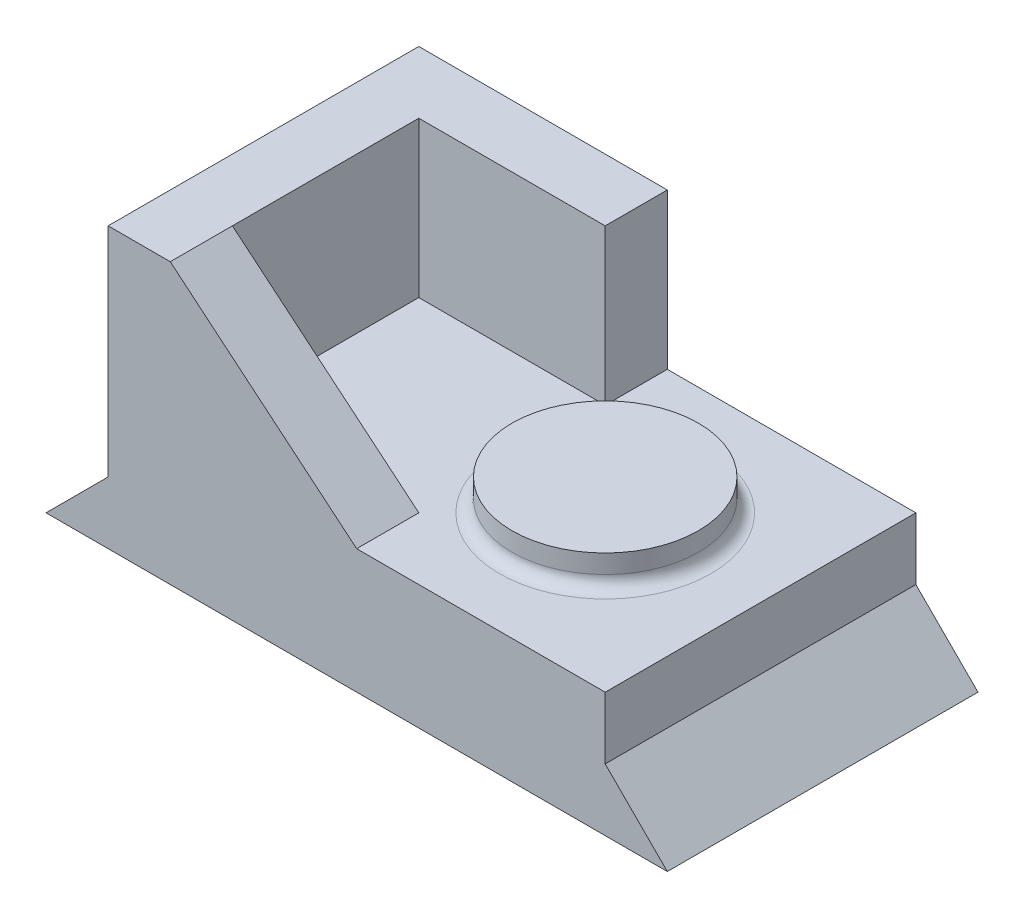
ISO-10303-21;
HEADER;
FILE_DESCRIPTION(('STEP AP214'),'2;1');
FILE_NAME('part.step','',(''),(''),'','','');
FILE_SCHEMA(('AUTOMOTIVE_DESIGN { 1 0 10303 214 1 1 1 1 }'));
ENDSEC;
DATA;
#1=APPLICATION_CONTEXT('core data for automotive mechanical design processes');
#2=APPLICATION_PROTOCOL_DEFINITION('international standard','automotive_design',2000,#1);
#3=PRODUCT_CONTEXT('',#1,'mechanical');
#4=PRODUCT('Part','Part','',(#3));
#5=PRODUCT_RELATED_PRODUCT_CATEGORY('part','',(#4));
#6=PRODUCT_DEFINITION_FORMATION('','',#4);
#7=PRODUCT_DEFINITION_CONTEXT('part definition',#1,'design');
#8=PRODUCT_DEFINITION('design','',#6,#7);
#9=PRODUCT_DEFINITION_SHAPE('','',#8);
#10=(LENGTH_UNIT() NAMED_UNIT(*) SI_UNIT(.MILLI.,.METRE.));
#11=(NAMED_UNIT(*) PLANE_ANGLE_UNIT() SI_UNIT($,.RADIAN.));
#12=(NAMED_UNIT(*) SI_UNIT($,.STERADIAN.) SOLID_ANGLE_UNIT());
#13=UNCERTAINTY_MEASURE_WITH_UNIT(LENGTH_MEASURE(1.E-05),#10,'distance_accuracy_value','');
#14=(GEOMETRIC_REPRESENTATION_CONTEXT(3) GLOBAL_UNCERTAINTY_ASSIGNED_CONTEXT((#13)) GLOBAL_UNIT_ASSIGNED_CONTEXT((#10,
#11,#12)) REPRESENTATION_CONTEXT('',''));
#15=CARTESIAN_POINT('',(0.,0.,0.));
#16=DIRECTION('',(0.,0.,1.));
#17=DIRECTION('',(1.,0.,0.));
#18=AXIS2_PLACEMENT_3D('',#15,#16,#17);
#19=CARTESIAN_POINT('',(0.,20.,25.));
#20=DIRECTION('',(0.,-1.,0.));
#21=DIRECTION('',(1.,0.,0.));
#22=AXIS2_PLACEMENT_3D('',#19,#20,#21);
#23=PLANE('',#22);
#24=CARTESIAN_POINT('',(65.,20.,0.));
#25=DIRECTION('',(0.,-1.,0.));
#26=DIRECTION('',(1.,0.,0.));
#27=AXIS2_PLACEMENT_3D('',#24,#25,#26);
#28=CIRCLE('',#27,17.);
#29=CARTESIAN_POINT('',(82.,20.,0.));
#30=VERTEX_POINT('',#29);
#31=EDGE_CURVE('E11',#30,#30,#28,.T.);
#32=ORIENTED_EDGE('',*,*,#31,.T.);
#33=EDGE_LOOP('',(#32));
#34=FACE_BOUND('',#33,.T.);
#35=DIRECTION('',(-1.,0.,0.));
#36=VECTOR('',#35,1.);
#37=CARTESIAN_POINT('',(0.,20.,-25.));
#38=LINE('',#37,#36);
#39=CARTESIAN_POINT('',(90.,20.,-25.));
#40=VERTEX_POINT('',#39);
#41=CARTESIAN_POINT('',(50.,20.,-25.));
#42=VERTEX_POINT('',#41);
#43=EDGE_CURVE('E154',#40,#42,#38,.T.);
#44=ORIENTED_EDGE('',*,*,#43,.T.);
#45=DIRECTION('',(0.,0.,1.));
#46=VECTOR('',#45,1.);
#47=CARTESIAN_POINT('',(50.,20.,-64.0512483795333));
#48=LINE('',#47,#46);
#49=CARTESIAN_POINT('',(50.,20.,-15.));
#50=VERTEX_POINT('',#49);
#51=EDGE_CURVE('E145',#42,#50,#48,.T.);
#52=ORIENTED_EDGE('',*,*,#51,.T.);
#53=DIRECTION('',(-1.,0.,0.));
#54=VECTOR('',#53,1.);
#55=CARTESIAN_POINT('',(0.,20.,-15.));
#56=LINE('',#55,#54);
#57=CARTESIAN_POINT('',(20.,20.,-15.));
#58=VERTEX_POINT('',#57);
#59=EDGE_CURVE('E132',#50,#58,#56,.T.);
#60=ORIENTED_EDGE('',*,*,#59,.T.);
#61=DIRECTION('',(0.,0.,-1.));
#62=VECTOR('',#61,1.);
#63=CARTESIAN_POINT('',(20.,20.,25.));
#64=LINE('',#63,#62);
#65=CARTESIAN_POINT('',(20.,20.,15.));
#66=VERTEX_POINT('',#65);
#67=EDGE_CURVE('E214',#66,#58,#64,.T.);
#68=ORIENTED_EDGE('',*,*,#67,.F.);
#69=DIRECTION('',(-1.,0.,0.));
#70=VECTOR('',#69,1.);
#71=CARTESIAN_POINT('',(0.,20.,15.));
#72=LINE('',#71,#70);
#73=CARTESIAN_POINT('',(50.,20.,15.));
#74=VERTEX_POINT('',#73);
#75=EDGE_CURVE('E60',#74,#66,#72,.T.);
#76=ORIENTED_EDGE('',*,*,#75,.F.);
#77=DIRECTION('',(0.,0.,-1.));
#78=VECTOR('',#77,1.);
#79=CARTESIAN_POINT('',(50.,20.,64.0512483795333));
#80=LINE('',#79,#78);
#81=CARTESIAN_POINT('',(50.,20.,25.));
#82=VERTEX_POINT('',#81);
#83=EDGE_CURVE('E164',#82,#74,#80,.T.);
#84=ORIENTED_EDGE('',*,*,#83,.F.);
#85=DIRECTION('',(-1.,0.,0.));
#86=VECTOR('',#85,1.);
#87=CARTESIAN_POINT('',(0.,20.,25.));
#88=LINE('',#87,#86);
#89=CARTESIAN_POINT('',(90.,20.,25.));
#90=VERTEX_POINT('',#89);
#91=EDGE_CURVE('E180',#90,#82,#88,.T.);
#92=ORIENTED_EDGE('',*,*,#91,.F.);
#93=DIRECTION('',(0.,0.,-1.));
#94=VECTOR('',#93,1.);
#95=CARTESIAN_POINT('',(90.,20.,25.));
#96=LINE('',#95,#94);
#97=EDGE_CURVE('E216',#90,#40,#96,.T.);
#98=ORIENTED_EDGE('',*,*,#97,.T.);
#99=EDGE_LOOP('',(#44,#52,#60,#68,#76,#84,#92,#98));
#100=FACE_BOUND('',#99,.T.);
#101=ADVANCED_FACE('F45',(#34,#100),#23,.F.);
#102=CARTESIAN_POINT('',(20.,0.,25.));
#103=DIRECTION('',(1.,0.,0.));
#104=DIRECTION('',(0.,1.,0.));
#105=AXIS2_PLACEMENT_3D('',#102,#103,#104);
#106=PLANE('',#105);
#107=DIRECTION('',(0.,-1.,0.));
#108=VECTOR('',#107,1.);
#109=CARTESIAN_POINT('',(20.,0.,-15.));
#110=LINE('',#109,#108);
#111=CARTESIAN_POINT('',(20.,45.,-15.));
#112=VERTEX_POINT('',#111);
#113=EDGE_CURVE('E137',#112,#58,#110,.T.);
#114=ORIENTED_EDGE('',*,*,#113,.F.);
#115=DIRECTION('',(0.,0.,-1.));
#116=VECTOR('',#115,1.);
#117=CARTESIAN_POINT('',(20.,45.,25.));
#118=LINE('',#117,#116);
#119=CARTESIAN_POINT('',(20.,45.,15.));
#120=VERTEX_POINT('',#119);
#121=EDGE_CURVE('E210',#120,#112,#118,.T.);
#122=ORIENTED_EDGE('',*,*,#121,.F.);
#123=DIRECTION('',(0.,-1.,0.));
#124=VECTOR('',#123,1.);
#125=CARTESIAN_POINT('',(20.,0.,15.));
#126=LINE('',#125,#124);
#127=EDGE_CURVE('E68',#120,#66,#126,.T.);
#128=ORIENTED_EDGE('',*,*,#127,.T.);
#129=ORIENTED_EDGE('',*,*,#67,.T.);
#130=EDGE_LOOP('',(#114,#122,#128,#129));
#131=FACE_BOUND('',#130,.T.);
#132=ADVANCED_FACE('F238',(#131),#106,.T.);
#133=CARTESIAN_POINT('',(0.,0.,25.));
#134=DIRECTION('',(0.,1.,0.));
#135=DIRECTION('',(0.,0.,1.));
#136=AXIS2_PLACEMENT_3D('',#133,#134,#135);
#137=PLANE('',#136);
#138=DIRECTION('',(1.,0.,0.));
#139=VECTOR('',#138,1.);
#140=CARTESIAN_POINT('',(0.,0.,-25.));
#141=LINE('',#140,#139);
#142=CARTESIAN_POINT('',(0.,0.,-25.));
#143=VERTEX_POINT('',#142);
#144=CARTESIAN_POINT('',(100.,0.,-25.));
#145=VERTEX_POINT('',#144);
#146=EDGE_CURVE('E168',#143,#145,#141,.T.);
#147=ORIENTED_EDGE('',*,*,#146,.T.);
#148=DIRECTION('',(0.,0.,-1.));
#149=VECTOR('',#148,1.);
#150=CARTESIAN_POINT('',(100.,0.,25.));
#151=LINE('',#150,#149);
#152=CARTESIAN_POINT('',(100.,0.,25.));
#153=VERTEX_POINT('',#152);
#154=EDGE_CURVE('E221',#153,#145,#151,.T.);
#155=ORIENTED_EDGE('',*,*,#154,.F.);
#156=DIRECTION('',(1.,0.,0.));
#157=VECTOR('',#156,1.);
#158=CARTESIAN_POINT('',(0.,0.,25.));
#159=LINE('',#158,#157);
#160=CARTESIAN_POINT('',(0.,0.,25.));
#161=VERTEX_POINT('',#160);
#162=EDGE_CURVE('E172',#161,#153,#159,.T.);
#163=ORIENTED_EDGE('',*,*,#162,.F.);
#164=DIRECTION('',(0.,0.,-1.));
#165=VECTOR('',#164,1.);
#166=CARTESIAN_POINT('',(0.,0.,25.));
#167=LINE('',#166,#165);
#168=EDGE_CURVE('E189',#161,#143,#167,.T.);
#169=ORIENTED_EDGE('',*,*,#168,.T.);
#170=EDGE_LOOP('',(#147,#155,#163,#169));
#171=FACE_BOUND('',#170,.T.);
#172=ADVANCED_FACE('F244',(#171),#137,.F.);
#173=CARTESIAN_POINT('',(50.,50.,25.));
#174=DIRECTION('',(-0.707106781186548,-0.707106781186547,0.));
#175=DIRECTION('',(0.707106781186547,-0.707106781186548,0.));
#176=AXIS2_PLACEMENT_3D('',#173,#174,#175);
#177=PLANE('',#176);
#178=DIRECTION('',(-0.707106781186547,0.707106781186548,0.));
#179=VECTOR('',#178,1.);
#180=CARTESIAN_POINT('',(50.,50.,-25.));
#181=LINE('',#180,#179);
#182=CARTESIAN_POINT('',(90.,9.99999999999999,-25.));
#183=VERTEX_POINT('',#182);
#184=EDGE_CURVE('E192',#145,#183,#181,.T.);
#185=ORIENTED_EDGE('',*,*,#184,.T.);
#186=DIRECTION('',(0.,0.,-1.));
#187=VECTOR('',#186,1.);
#188=CARTESIAN_POINT('',(90.,9.99999999999999,25.));
#189=LINE('',#188,#187);
#190=CARTESIAN_POINT('',(90.,9.99999999999999,25.));
#191=VERTEX_POINT('',#190);
#192=EDGE_CURVE('E218',#191,#183,#189,.T.);
#193=ORIENTED_EDGE('',*,*,#192,.F.);
#194=DIRECTION('',(-0.707106781186547,0.707106781186548,0.));
#195=VECTOR('',#194,1.);
#196=CARTESIAN_POINT('',(50.,50.,25.));
#197=LINE('',#196,#195);
#198=EDGE_CURVE('E175',#153,#191,#197,.T.);
#199=ORIENTED_EDGE('',*,*,#198,.F.);
#200=ORIENTED_EDGE('',*,*,#154,.T.);
#201=EDGE_LOOP('',(#185,#193,#199,#200));
#202=FACE_BOUND('',#201,.T.);
#203=ADVANCED_FACE('F252',(#202),#177,.F.);
#204=CARTESIAN_POINT('',(90.,0.,25.));
#205=DIRECTION('',(-1.,0.,0.));
#206=DIRECTION('',(0.,0.,1.));
#207=AXIS2_PLACEMENT_3D('',#204,#205,#206);
#208=PLANE('',#207);
#209=DIRECTION('',(0.,1.,0.));
#210=VECTOR('',#209,1.);
#211=CARTESIAN_POINT('',(90.,0.,-25.));
#212=LINE('',#211,#210);
#213=EDGE_CURVE('E194',#183,#40,#212,.T.);
#214=ORIENTED_EDGE('',*,*,#213,.T.);
#215=ORIENTED_EDGE('',*,*,#97,.F.);
#216=DIRECTION('',(0.,1.,0.));
#217=VECTOR('',#216,1.);
#218=CARTESIAN_POINT('',(90.,0.,25.));
#219=LINE('',#218,#217);
#220=EDGE_CURVE('E178',#191,#90,#219,.T.);
#221=ORIENTED_EDGE('',*,*,#220,.F.);
#222=ORIENTED_EDGE('',*,*,#192,.T.);
#223=EDGE_LOOP('',(#214,#215,#221,#222));
#224=FACE_BOUND('',#223,.T.);
#225=ADVANCED_FACE('F248',(#224),#208,.F.);
#226=CARTESIAN_POINT('',(0.,45.,25.));
#227=DIRECTION('',(0.,-1.,0.));
#228=DIRECTION('',(1.,0.,0.));
#229=AXIS2_PLACEMENT_3D('',#226,#227,#228);
#230=PLANE('',#229);
#231=DIRECTION('',(-1.,0.,0.));
#232=VECTOR('',#231,1.);
#233=CARTESIAN_POINT('',(0.,45.,-25.));
#234=LINE('',#233,#232);
#235=CARTESIAN_POINT('',(50.,45.,-25.));
#236=VERTEX_POINT('',#235);
#237=CARTESIAN_POINT('',(10.,45.,-25.));
#238=VERTEX_POINT('',#237);
#239=EDGE_CURVE('E197',#236,#238,#234,.T.);
#240=ORIENTED_EDGE('',*,*,#239,.T.);
#241=DIRECTION('',(0.,0.,-1.));
#242=VECTOR('',#241,1.);
#243=CARTESIAN_POINT('',(10.,45.,25.));
#244=LINE('',#243,#242);
#245=CARTESIAN_POINT('',(10.,45.,25.));
#246=VERTEX_POINT('',#245);
#247=EDGE_CURVE('E207',#246,#238,#244,.T.);
#248=ORIENTED_EDGE('',*,*,#247,.F.);
#249=DIRECTION('',(-1.,0.,0.));
#250=VECTOR('',#249,1.);
#251=CARTESIAN_POINT('',(0.,45.,25.));
#252=LINE('',#251,#250);
#253=CARTESIAN_POINT('',(20.,45.,25.));
#254=VERTEX_POINT('',#253);
#255=EDGE_CURVE('E183',#254,#246,#252,.T.);
#256=ORIENTED_EDGE('',*,*,#255,.F.);
#257=EDGE_CURVE('E211',#254,#120,#118,.T.);
#258=ORIENTED_EDGE('',*,*,#257,.T.);
#259=ORIENTED_EDGE('',*,*,#121,.T.);
#260=DIRECTION('',(-1.,0.,0.));
#261=VECTOR('',#260,1.);
#262=CARTESIAN_POINT('',(0.,45.,-15.));
#263=LINE('',#262,#261);
#264=CARTESIAN_POINT('',(50.,45.,-15.));
#265=VERTEX_POINT('',#264);
#266=EDGE_CURVE('E150',#265,#112,#263,.T.);
#267=ORIENTED_EDGE('',*,*,#266,.F.);
#268=DIRECTION('',(0.,0.,1.));
#269=VECTOR('',#268,1.);
#270=CARTESIAN_POINT('',(50.,45.,-64.0512483795333));
#271=LINE('',#270,#269);
#272=EDGE_CURVE('E148',#236,#265,#271,.T.);
#273=ORIENTED_EDGE('',*,*,#272,.F.);
#274=EDGE_LOOP('',(#240,#248,#256,#258,#259,#267,#273));
#275=FACE_BOUND('',#274,.T.);
#276=ADVANCED_FACE('F251',(#275),#230,.F.);
#277=CARTESIAN_POINT('',(10.,0.,25.));
#278=DIRECTION('',(1.,0.,0.));
#279=DIRECTION('',(0.,1.,0.));
#280=AXIS2_PLACEMENT_3D('',#277,#278,#279);
#281=PLANE('',#280);
#282=DIRECTION('',(0.,-1.,0.));
#283=VECTOR('',#282,1.);
#284=CARTESIAN_POINT('',(10.,0.,-25.));
#285=LINE('',#284,#283);
#286=CARTESIAN_POINT('',(10.,10.,-25.));
#287=VERTEX_POINT('',#286);
#288=EDGE_CURVE('E199',#238,#287,#285,.T.);
#289=ORIENTED_EDGE('',*,*,#288,.T.);
#290=DIRECTION('',(0.,0.,-1.));
#291=VECTOR('',#290,1.);
#292=CARTESIAN_POINT('',(10.,10.,25.));
#293=LINE('',#292,#291);
#294=CARTESIAN_POINT('',(10.,10.,25.));
#295=VERTEX_POINT('',#294);
#296=EDGE_CURVE('E204',#295,#287,#293,.T.);
#297=ORIENTED_EDGE('',*,*,#296,.F.);
#298=DIRECTION('',(0.,-1.,0.));
#299=VECTOR('',#298,1.);
#300=CARTESIAN_POINT('',(10.,0.,25.));
#301=LINE('',#300,#299);
#302=EDGE_CURVE('E185',#246,#295,#301,.T.);
#303=ORIENTED_EDGE('',*,*,#302,.F.);
#304=ORIENTED_EDGE('',*,*,#247,.T.);
#305=EDGE_LOOP('',(#289,#297,#303,#304));
#306=FACE_BOUND('',#305,.T.);
#307=ADVANCED_FACE('F279',(#306),#281,.F.);
#308=CARTESIAN_POINT('',(0.,0.,25.));
#309=DIRECTION('',(0.707106781186547,-0.707106781186548,0.));
#310=DIRECTION('',(0.707106781186548,0.707106781186547,0.));
#311=AXIS2_PLACEMENT_3D('',#308,#309,#310);
#312=PLANE('',#311);
#313=DIRECTION('',(-0.707106781186548,-0.707106781186547,0.));
#314=VECTOR('',#313,1.);
#315=CARTESIAN_POINT('',(0.,0.,-25.));
#316=LINE('',#315,#314);
#317=EDGE_CURVE('E176',#287,#143,#316,.T.);
#318=ORIENTED_EDGE('',*,*,#317,.T.);
#319=ORIENTED_EDGE('',*,*,#168,.F.);
#320=DIRECTION('',(-0.707106781186548,-0.707106781186547,0.));
#321=VECTOR('',#320,1.);
#322=CARTESIAN_POINT('',(0.,0.,25.));
#323=LINE('',#322,#321);
#324=EDGE_CURVE('E187',#295,#161,#323,.T.);
#325=ORIENTED_EDGE('',*,*,#324,.F.);
#326=ORIENTED_EDGE('',*,*,#296,.T.);
#327=EDGE_LOOP('',(#318,#319,#325,#326));
#328=FACE_BOUND('',#327,.T.);
#329=ADVANCED_FACE('F277',(#328),#312,.F.);
#330=CARTESIAN_POINT('',(0.,0.,25.));
#331=DIRECTION('',(0.,0.,1.));
#332=DIRECTION('',(1.,0.,0.));
#333=AXIS2_PLACEMENT_3D('',#330,#331,#332);
#334=PLANE('',#333);
#335=ORIENTED_EDGE('',*,*,#162,.T.);
#336=ORIENTED_EDGE('',*,*,#198,.T.);
#337=ORIENTED_EDGE('',*,*,#220,.T.);
#338=ORIENTED_EDGE('',*,*,#91,.T.);
#339=DIRECTION('',(-0.768221279597376,0.64018439966448,0.));
#340=VECTOR('',#339,1.);
#341=CARTESIAN_POINT('',(30.327868852459,36.3934426229508,25.));
#342=LINE('',#341,#340);
#343=EDGE_CURVE('E161',#82,#254,#342,.T.);
#344=ORIENTED_EDGE('',*,*,#343,.T.);
#345=ORIENTED_EDGE('',*,*,#255,.T.);
#346=ORIENTED_EDGE('',*,*,#302,.T.);
#347=ORIENTED_EDGE('',*,*,#324,.T.);
#348=EDGE_LOOP('',(#335,#336,#337,#338,#344,#345,#346,#347));
#349=FACE_BOUND('',#348,.T.);
#350=ADVANCED_FACE('F272',(#349),#334,.T.);
#351=CARTESIAN_POINT('',(0.,0.,-25.));
#352=DIRECTION('',(0.,0.,1.));
#353=DIRECTION('',(1.,0.,0.));
#354=AXIS2_PLACEMENT_3D('',#351,#352,#353);
#355=PLANE('',#354);
#356=DIRECTION('',(0.,-1.,0.));
#357=VECTOR('',#356,1.);
#358=CARTESIAN_POINT('',(50.,0.,-25.));
#359=LINE('',#358,#357);
#360=EDGE_CURVE('E156',#236,#42,#359,.T.);
#361=ORIENTED_EDGE('',*,*,#360,.T.);
#362=ORIENTED_EDGE('',*,*,#43,.F.);
#363=ORIENTED_EDGE('',*,*,#213,.F.);
#364=ORIENTED_EDGE('',*,*,#184,.F.);
#365=ORIENTED_EDGE('',*,*,#146,.F.);
#366=ORIENTED_EDGE('',*,*,#317,.F.);
#367=ORIENTED_EDGE('',*,*,#288,.F.);
#368=ORIENTED_EDGE('',*,*,#239,.F.);
#369=EDGE_LOOP('',(#361,#362,#363,#364,#365,#366,#367,#368));
#370=FACE_BOUND('',#369,.T.);
#371=ADVANCED_FACE('F266',(#370),#355,.F.);
#372=CARTESIAN_POINT('',(0.,0.,15.));
#373=DIRECTION('',(0.,0.,1.));
#374=DIRECTION('',(1.,0.,0.));
#375=AXIS2_PLACEMENT_3D('',#372,#373,#374);
#376=PLANE('',#375);
#377=DIRECTION('',(-0.768221279597376,0.64018439966448,0.));
#378=VECTOR('',#377,1.);
#379=CARTESIAN_POINT('',(30.327868852459,36.3934426229508,15.));
#380=LINE('',#379,#378);
#381=EDGE_CURVE('E165',#74,#120,#380,.T.);
#382=ORIENTED_EDGE('',*,*,#381,.F.);
#383=ORIENTED_EDGE('',*,*,#75,.T.);
#384=ORIENTED_EDGE('',*,*,#127,.F.);
#385=EDGE_LOOP('',(#382,#383,#384));
#386=FACE_BOUND('',#385,.T.);
#387=ADVANCED_FACE('F298',(#386),#376,.F.);
#388=CARTESIAN_POINT('',(30.327868852459,36.3934426229508,64.0512483795333));
#389=DIRECTION('',(-0.64018439966448,-0.768221279597376,0.));
#390=DIRECTION('',(0.768221279597376,-0.64018439966448,0.));
#391=AXIS2_PLACEMENT_3D('',#388,#389,#390);
#392=PLANE('',#391);
#393=ORIENTED_EDGE('',*,*,#343,.F.);
#394=ORIENTED_EDGE('',*,*,#83,.T.);
#395=ORIENTED_EDGE('',*,*,#381,.T.);
#396=ORIENTED_EDGE('',*,*,#257,.F.);
#397=EDGE_LOOP('',(#393,#394,#395,#396));
#398=FACE_BOUND('',#397,.T.);
#399=ADVANCED_FACE('F297',(#398),#392,.F.);
#400=CARTESIAN_POINT('',(50.,0.,-64.0512483795333));
#401=DIRECTION('',(1.,0.,0.));
#402=DIRECTION('',(0.,0.,-1.));
#403=AXIS2_PLACEMENT_3D('',#400,#401,#402);
#404=PLANE('',#403);
#405=ORIENTED_EDGE('',*,*,#360,.F.);
#406=ORIENTED_EDGE('',*,*,#272,.T.);
#407=DIRECTION('',(0.,1.,0.));
#408=VECTOR('',#407,1.);
#409=CARTESIAN_POINT('',(50.,0.,-15.));
#410=LINE('',#409,#408);
#411=EDGE_CURVE('E135',#50,#265,#410,.T.);
#412=ORIENTED_EDGE('',*,*,#411,.F.);
#413=ORIENTED_EDGE('',*,*,#51,.F.);
#414=EDGE_LOOP('',(#405,#406,#412,#413));
#415=FACE_BOUND('',#414,.T.);
#416=ADVANCED_FACE('F144',(#415),#404,.T.);
#417=CARTESIAN_POINT('',(0.,0.,-15.));
#418=DIRECTION('',(0.,0.,1.));
#419=DIRECTION('',(1.,0.,0.));
#420=AXIS2_PLACEMENT_3D('',#417,#418,#419);
#421=PLANE('',#420);
#422=ORIENTED_EDGE('',*,*,#59,.F.);
#423=ORIENTED_EDGE('',*,*,#411,.T.);
#424=ORIENTED_EDGE('',*,*,#266,.T.);
#425=ORIENTED_EDGE('',*,*,#113,.T.);
#426=EDGE_LOOP('',(#422,#423,#424,#425));
#427=FACE_BOUND('',#426,.T.);
#428=ADVANCED_FACE('F134',(#427),#421,.T.);
#429=CARTESIAN_POINT('',(0.,25.,0.));
#430=DIRECTION('',(0.,-1.,0.));
#431=DIRECTION('',(1.,0.,0.));
#432=AXIS2_PLACEMENT_3D('',#429,#430,#431);
#433=PLANE('',#432);
#434=CARTESIAN_POINT('',(65.,25.,0.));
#435=DIRECTION('',(0.,1.,0.));
#436=DIRECTION('',(-1.,0.,0.));
#437=AXIS2_PLACEMENT_3D('',#434,#435,#436);
#438=CIRCLE('',#437,15.);
#439=CARTESIAN_POINT('',(50.,25.,0.));
#440=VERTEX_POINT('',#439);
#441=EDGE_CURVE('E139',#440,#440,#438,.T.);
#442=ORIENTED_EDGE('',*,*,#441,.T.);
#443=EDGE_LOOP('',(#442));
#444=FACE_BOUND('',#443,.T.);
#445=ADVANCED_FACE('F234',(#444),#433,.F.);
#446=CARTESIAN_POINT('',(65.,46.3345195729537,0.));
#447=DIRECTION('',(0.,1.,0.));
#448=DIRECTION('',(-1.,0.,0.));
#449=AXIS2_PLACEMENT_3D('',#446,#447,#448);
#450=CYLINDRICAL_SURFACE('',#449,15.);
#451=CARTESIAN_POINT('',(65.,22.,0.));
#452=DIRECTION('',(0.,-1.,0.));
#453=DIRECTION('',(1.,0.,0.));
#454=AXIS2_PLACEMENT_3D('',#451,#452,#453);
#455=CIRCLE('',#454,15.);
#456=CARTESIAN_POINT('',(80.,22.,0.));
#457=VERTEX_POINT('',#456);
#458=EDGE_CURVE('E53',#457,#457,#455,.F.);
#459=ORIENTED_EDGE('',*,*,#458,.T.);
#460=EDGE_LOOP('',(#459));
#461=FACE_BOUND('',#460,.T.);
#462=ORIENTED_EDGE('',*,*,#441,.F.);
#463=EDGE_LOOP('',(#462));
#464=FACE_BOUND('',#463,.T.);
#465=ADVANCED_FACE('F226',(#461,#464),#450,.T.);
#466=CARTESIAN_POINT('',(65.,22.,0.));
#467=DIRECTION('',(0.,-1.,0.));
#468=DIRECTION('',(1.,0.,0.));
#469=AXIS2_PLACEMENT_3D('',#466,#467,#468);
#470=TOROIDAL_SURFACE('',#469,17.,2.);
#471=ORIENTED_EDGE('',*,*,#31,.F.);
#472=EDGE_LOOP('',(#471));
#473=FACE_BOUND('',#472,.T.);
#474=ORIENTED_EDGE('',*,*,#458,.F.);
#475=EDGE_LOOP('',(#474));
#476=FACE_BOUND('',#475,.T.);
#477=ADVANCED_FACE('F47',(#473,#476),#470,.F.);
#478=CLOSED_SHELL('',(#101,#132,#172,#203,#225,#276,#307,#329,#350,#371,#387,#399,#416,#428,
#445,#465,#477));
#479=MANIFOLD_SOLID_BREP('B2',#478);
#480=ADVANCED_BREP_SHAPE_REPRESENTATION('',(#18,#479),#14);
#481=SHAPE_DEFINITION_REPRESENTATION(#9,#480);
ENDSEC;
END-ISO-10303-21;
